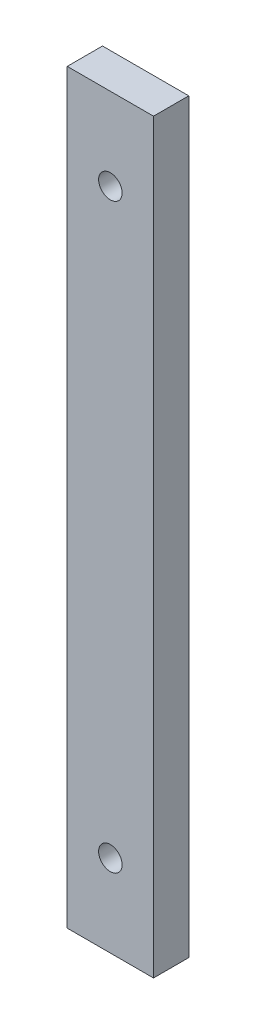
ISO-10303-21;
HEADER;
FILE_DESCRIPTION(('STEP AP214'),'2;1');
FILE_NAME('part.step','',(''),(''),'','','');
FILE_SCHEMA(('AUTOMOTIVE_DESIGN { 1 0 10303 214 1 1 1 1 }'));
ENDSEC;
DATA;
#1=APPLICATION_CONTEXT('core data for automotive mechanical design processes');
#2=APPLICATION_PROTOCOL_DEFINITION('international standard','automotive_design',2000,#1);
#3=PRODUCT_CONTEXT('',#1,'mechanical');
#4=PRODUCT('Part','Part','',(#3));
#5=PRODUCT_RELATED_PRODUCT_CATEGORY('part','',(#4));
#6=PRODUCT_DEFINITION_FORMATION('','',#4);
#7=PRODUCT_DEFINITION_CONTEXT('part definition',#1,'design');
#8=PRODUCT_DEFINITION('design','',#6,#7);
#9=PRODUCT_DEFINITION_SHAPE('','',#8);
#10=(LENGTH_UNIT() NAMED_UNIT(*) SI_UNIT(.MILLI.,.METRE.));
#11=(NAMED_UNIT(*) PLANE_ANGLE_UNIT() SI_UNIT($,.RADIAN.));
#12=(NAMED_UNIT(*) SI_UNIT($,.STERADIAN.) SOLID_ANGLE_UNIT());
#13=UNCERTAINTY_MEASURE_WITH_UNIT(LENGTH_MEASURE(1.E-05),#10,'distance_accuracy_value','');
#14=(GEOMETRIC_REPRESENTATION_CONTEXT(3) GLOBAL_UNCERTAINTY_ASSIGNED_CONTEXT((#13)) GLOBAL_UNIT_ASSIGNED_CONTEXT((#10,
#11,#12)) REPRESENTATION_CONTEXT('',''));
#15=CARTESIAN_POINT('',(0.,0.,0.));
#16=DIRECTION('',(0.,0.,1.));
#17=DIRECTION('',(1.,0.,0.));
#18=AXIS2_PLACEMENT_3D('',#15,#16,#17);
#19=CARTESIAN_POINT('',(0.,0.,6.));
#20=DIRECTION('',(0.,0.,1.));
#21=DIRECTION('',(1.,0.,0.));
#22=AXIS2_PLACEMENT_3D('',#19,#20,#21);
#23=PLANE('',#22);
#24=CARTESIAN_POINT('',(0.,49.5,6.));
#25=DIRECTION('',(0.,0.,1.));
#26=DIRECTION('',(1.,0.,0.));
#27=AXIS2_PLACEMENT_3D('',#24,#25,#26);
#28=CIRCLE('',#27,2.);
#29=CARTESIAN_POINT('',(2.,49.5,6.));
#30=VERTEX_POINT('',#29);
#31=EDGE_CURVE('E111',#30,#30,#28,.F.);
#32=ORIENTED_EDGE('',*,*,#31,.T.);
#33=EDGE_LOOP('',(#32));
#34=FACE_BOUND('',#33,.T.);
#35=DIRECTION('',(0.,1.,0.));
#36=VECTOR('',#35,1.);
#37=CARTESIAN_POINT('',(7.33999999999999,63.5,6.));
#38=LINE('',#37,#36);
#39=CARTESIAN_POINT('',(7.34000000000001,-63.5,6.));
#40=VERTEX_POINT('',#39);
#41=CARTESIAN_POINT('',(7.33999999999999,63.5,6.));
#42=VERTEX_POINT('',#41);
#43=EDGE_CURVE('E84',#40,#42,#38,.T.);
#44=ORIENTED_EDGE('',*,*,#43,.T.);
#45=DIRECTION('',(-1.,0.,0.));
#46=VECTOR('',#45,1.);
#47=CARTESIAN_POINT('',(-7.34000000000001,63.5,6.));
#48=LINE('',#47,#46);
#49=CARTESIAN_POINT('',(-7.34000000000001,63.5,6.));
#50=VERTEX_POINT('',#49);
#51=EDGE_CURVE('E79',#42,#50,#48,.T.);
#52=ORIENTED_EDGE('',*,*,#51,.T.);
#53=DIRECTION('',(0.,-1.,0.));
#54=VECTOR('',#53,1.);
#55=CARTESIAN_POINT('',(-7.34000000000001,63.5,6.));
#56=LINE('',#55,#54);
#57=CARTESIAN_POINT('',(-7.33999999999999,-63.5,6.));
#58=VERTEX_POINT('',#57);
#59=EDGE_CURVE('E82',#50,#58,#56,.T.);
#60=ORIENTED_EDGE('',*,*,#59,.T.);
#61=DIRECTION('',(1.,0.,0.));
#62=VECTOR('',#61,1.);
#63=CARTESIAN_POINT('',(-7.33999999999999,-63.5,6.));
#64=LINE('',#63,#62);
#65=EDGE_CURVE('E49',#58,#40,#64,.T.);
#66=ORIENTED_EDGE('',*,*,#65,.T.);
#67=EDGE_LOOP('',(#44,#52,#60,#66));
#68=FACE_BOUND('',#67,.T.);
#69=CARTESIAN_POINT('',(0.,-49.5,6.));
#70=DIRECTION('',(0.,0.,1.));
#71=DIRECTION('',(1.,0.,0.));
#72=AXIS2_PLACEMENT_3D('',#69,#70,#71);
#73=CIRCLE('',#72,2.);
#74=CARTESIAN_POINT('',(2.,-49.5,6.));
#75=VERTEX_POINT('',#74);
#76=EDGE_CURVE('E117',#75,#75,#73,.T.);
#77=ORIENTED_EDGE('',*,*,#76,.F.);
#78=EDGE_LOOP('',(#77));
#79=FACE_BOUND('',#78,.T.);
#80=ADVANCED_FACE('F32',(#34,#68,#79),#23,.T.);
#81=CARTESIAN_POINT('',(0.,0.,0.));
#82=DIRECTION('',(0.,0.,1.));
#83=DIRECTION('',(1.,0.,0.));
#84=AXIS2_PLACEMENT_3D('',#81,#82,#83);
#85=PLANE('',#84);
#86=DIRECTION('',(0.,1.,0.));
#87=VECTOR('',#86,1.);
#88=CARTESIAN_POINT('',(7.33999999999999,63.5,0.));
#89=LINE('',#88,#87);
#90=CARTESIAN_POINT('',(7.34000000000001,-63.5,0.));
#91=VERTEX_POINT('',#90);
#92=CARTESIAN_POINT('',(7.33999999999999,63.5,0.));
#93=VERTEX_POINT('',#92);
#94=EDGE_CURVE('E96',#91,#93,#89,.T.);
#95=ORIENTED_EDGE('',*,*,#94,.F.);
#96=DIRECTION('',(1.,0.,0.));
#97=VECTOR('',#96,1.);
#98=CARTESIAN_POINT('',(-7.33999999999999,-63.5,0.));
#99=LINE('',#98,#97);
#100=CARTESIAN_POINT('',(-7.33999999999999,-63.5,0.));
#101=VERTEX_POINT('',#100);
#102=EDGE_CURVE('E72',#101,#91,#99,.T.);
#103=ORIENTED_EDGE('',*,*,#102,.F.);
#104=DIRECTION('',(0.,-1.,0.));
#105=VECTOR('',#104,1.);
#106=CARTESIAN_POINT('',(-7.34000000000001,63.5,0.));
#107=LINE('',#106,#105);
#108=CARTESIAN_POINT('',(-7.34000000000001,63.5,0.));
#109=VERTEX_POINT('',#108);
#110=EDGE_CURVE('E66',#109,#101,#107,.T.);
#111=ORIENTED_EDGE('',*,*,#110,.F.);
#112=DIRECTION('',(-1.,0.,0.));
#113=VECTOR('',#112,1.);
#114=CARTESIAN_POINT('',(-7.34000000000001,63.5,0.));
#115=LINE('',#114,#113);
#116=EDGE_CURVE('E88',#93,#109,#115,.T.);
#117=ORIENTED_EDGE('',*,*,#116,.F.);
#118=EDGE_LOOP('',(#95,#103,#111,#117));
#119=FACE_BOUND('',#118,.T.);
#120=CARTESIAN_POINT('',(0.,49.5,0.));
#121=DIRECTION('',(0.,0.,1.));
#122=DIRECTION('',(1.,0.,0.));
#123=AXIS2_PLACEMENT_3D('',#120,#121,#122);
#124=CIRCLE('',#123,2.);
#125=CARTESIAN_POINT('',(2.,49.5,0.));
#126=VERTEX_POINT('',#125);
#127=EDGE_CURVE('E114',#126,#126,#124,.F.);
#128=ORIENTED_EDGE('',*,*,#127,.F.);
#129=EDGE_LOOP('',(#128));
#130=FACE_BOUND('',#129,.T.);
#131=CARTESIAN_POINT('',(0.,-49.5,0.));
#132=DIRECTION('',(0.,0.,1.));
#133=DIRECTION('',(1.,0.,0.));
#134=AXIS2_PLACEMENT_3D('',#131,#132,#133);
#135=CIRCLE('',#134,2.);
#136=CARTESIAN_POINT('',(2.,-49.5,0.));
#137=VERTEX_POINT('',#136);
#138=EDGE_CURVE('E99',#137,#137,#135,.T.);
#139=ORIENTED_EDGE('',*,*,#138,.T.);
#140=EDGE_LOOP('',(#139));
#141=FACE_BOUND('',#140,.T.);
#142=ADVANCED_FACE('F107',(#119,#130,#141),#85,.F.);
#143=CARTESIAN_POINT('',(7.33999999999999,63.5,6.));
#144=DIRECTION('',(-1.,0.,0.));
#145=DIRECTION('',(0.,-1.,0.));
#146=AXIS2_PLACEMENT_3D('',#143,#144,#145);
#147=PLANE('',#146);
#148=ORIENTED_EDGE('',*,*,#94,.T.);
#149=DIRECTION('',(0.,0.,-1.));
#150=VECTOR('',#149,1.);
#151=CARTESIAN_POINT('',(7.33999999999999,63.5,6.));
#152=LINE('',#151,#150);
#153=EDGE_CURVE('E11',#42,#93,#152,.T.);
#154=ORIENTED_EDGE('',*,*,#153,.F.);
#155=ORIENTED_EDGE('',*,*,#43,.F.);
#156=DIRECTION('',(0.,0.,-1.));
#157=VECTOR('',#156,1.);
#158=CARTESIAN_POINT('',(7.34000000000001,-63.5,6.));
#159=LINE('',#158,#157);
#160=EDGE_CURVE('E92',#40,#91,#159,.T.);
#161=ORIENTED_EDGE('',*,*,#160,.T.);
#162=EDGE_LOOP('',(#148,#154,#155,#161));
#163=FACE_BOUND('',#162,.T.);
#164=ADVANCED_FACE('F34',(#163),#147,.F.);
#165=CARTESIAN_POINT('',(-7.34000000000001,63.5,6.));
#166=DIRECTION('',(0.,-1.,0.));
#167=DIRECTION('',(0.,0.,-1.));
#168=AXIS2_PLACEMENT_3D('',#165,#166,#167);
#169=PLANE('',#168);
#170=ORIENTED_EDGE('',*,*,#116,.T.);
#171=DIRECTION('',(0.,0.,-1.));
#172=VECTOR('',#171,1.);
#173=CARTESIAN_POINT('',(-7.34000000000001,63.5,6.));
#174=LINE('',#173,#172);
#175=EDGE_CURVE('E41',#50,#109,#174,.T.);
#176=ORIENTED_EDGE('',*,*,#175,.F.);
#177=ORIENTED_EDGE('',*,*,#51,.F.);
#178=ORIENTED_EDGE('',*,*,#153,.T.);
#179=EDGE_LOOP('',(#170,#176,#177,#178));
#180=FACE_BOUND('',#179,.T.);
#181=ADVANCED_FACE('F87',(#180),#169,.F.);
#182=CARTESIAN_POINT('',(-7.34000000000001,63.5,6.));
#183=DIRECTION('',(1.,0.,0.));
#184=DIRECTION('',(0.,1.,0.));
#185=AXIS2_PLACEMENT_3D('',#182,#183,#184);
#186=PLANE('',#185);
#187=ORIENTED_EDGE('',*,*,#110,.T.);
#188=DIRECTION('',(0.,0.,-1.));
#189=VECTOR('',#188,1.);
#190=CARTESIAN_POINT('',(-7.33999999999999,-63.5,6.));
#191=LINE('',#190,#189);
#192=EDGE_CURVE('E89',#58,#101,#191,.T.);
#193=ORIENTED_EDGE('',*,*,#192,.F.);
#194=ORIENTED_EDGE('',*,*,#59,.F.);
#195=ORIENTED_EDGE('',*,*,#175,.T.);
#196=EDGE_LOOP('',(#187,#193,#194,#195));
#197=FACE_BOUND('',#196,.T.);
#198=ADVANCED_FACE('F90',(#197),#186,.F.);
#199=CARTESIAN_POINT('',(-7.33999999999999,-63.5,6.));
#200=DIRECTION('',(0.,1.,0.));
#201=DIRECTION('',(0.,0.,1.));
#202=AXIS2_PLACEMENT_3D('',#199,#200,#201);
#203=PLANE('',#202);
#204=ORIENTED_EDGE('',*,*,#102,.T.);
#205=ORIENTED_EDGE('',*,*,#160,.F.);
#206=ORIENTED_EDGE('',*,*,#65,.F.);
#207=ORIENTED_EDGE('',*,*,#192,.T.);
#208=EDGE_LOOP('',(#204,#205,#206,#207));
#209=FACE_BOUND('',#208,.T.);
#210=ADVANCED_FACE('F104',(#209),#203,.F.);
#211=CARTESIAN_POINT('',(0.,49.5,0.));
#212=DIRECTION('',(0.,0.,1.));
#213=DIRECTION('',(1.,0.,0.));
#214=AXIS2_PLACEMENT_3D('',#211,#212,#213);
#215=CYLINDRICAL_SURFACE('',#214,2.);
#216=ORIENTED_EDGE('',*,*,#127,.T.);
#217=EDGE_LOOP('',(#216));
#218=FACE_BOUND('',#217,.T.);
#219=ORIENTED_EDGE('',*,*,#31,.F.);
#220=EDGE_LOOP('',(#219));
#221=FACE_BOUND('',#220,.T.);
#222=ADVANCED_FACE('F127',(#218,#221),#215,.F.);
#223=CARTESIAN_POINT('',(0.,-49.5,0.));
#224=DIRECTION('',(0.,0.,1.));
#225=DIRECTION('',(1.,0.,0.));
#226=AXIS2_PLACEMENT_3D('',#223,#224,#225);
#227=CYLINDRICAL_SURFACE('',#226,2.);
#228=ORIENTED_EDGE('',*,*,#138,.F.);
#229=EDGE_LOOP('',(#228));
#230=FACE_BOUND('',#229,.T.);
#231=ORIENTED_EDGE('',*,*,#76,.T.);
#232=EDGE_LOOP('',(#231));
#233=FACE_BOUND('',#232,.T.);
#234=ADVANCED_FACE('F124',(#230,#233),#227,.F.);
#235=CLOSED_SHELL('',(#80,#142,#164,#181,#198,#210,#222,#234));
#236=MANIFOLD_SOLID_BREP('B2',#235);
#237=ADVANCED_BREP_SHAPE_REPRESENTATION('',(#18,#236),#14);
#238=SHAPE_DEFINITION_REPRESENTATION(#9,#237);
ENDSEC;
END-ISO-10303-21;
